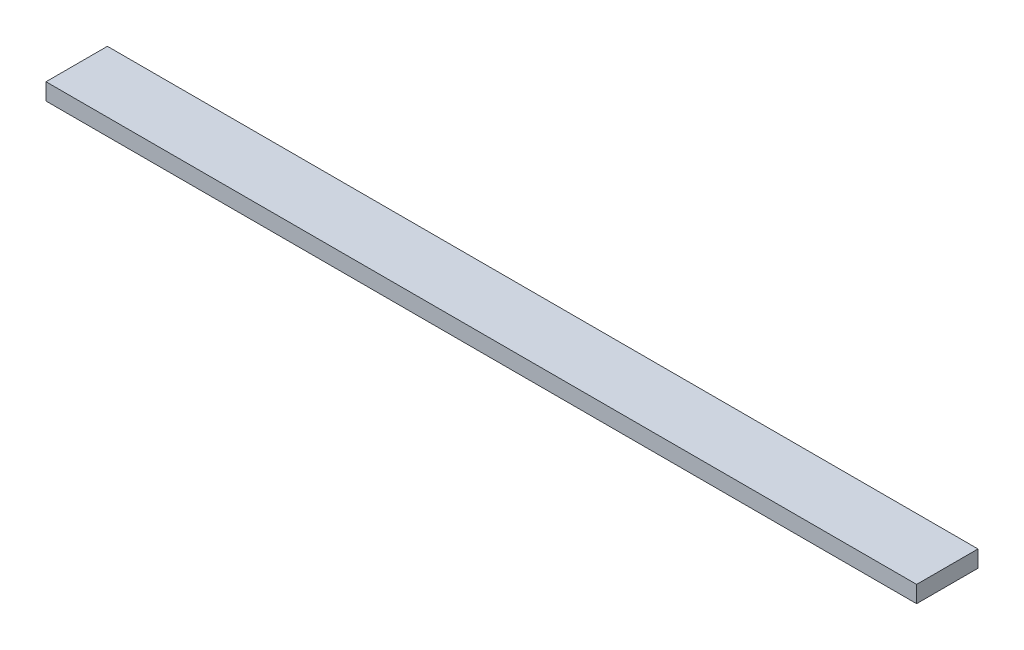
ISO-10303-21;
HEADER;
FILE_DESCRIPTION(('STEP AP214'),'2;1');
FILE_NAME('part.step','',(''),(''),'','','');
FILE_SCHEMA(('AUTOMOTIVE_DESIGN { 1 0 10303 214 1 1 1 1 }'));
ENDSEC;
DATA;
#1=APPLICATION_CONTEXT('core data for automotive mechanical design processes');
#2=APPLICATION_PROTOCOL_DEFINITION('international standard','automotive_design',2000,#1);
#3=PRODUCT_CONTEXT('',#1,'mechanical');
#4=PRODUCT('Part','Part','',(#3));
#5=PRODUCT_RELATED_PRODUCT_CATEGORY('part','',(#4));
#6=PRODUCT_DEFINITION_FORMATION('','',#4);
#7=PRODUCT_DEFINITION_CONTEXT('part definition',#1,'design');
#8=PRODUCT_DEFINITION('design','',#6,#7);
#9=PRODUCT_DEFINITION_SHAPE('','',#8);
#10=(LENGTH_UNIT() NAMED_UNIT(*) SI_UNIT(.MILLI.,.METRE.));
#11=(NAMED_UNIT(*) PLANE_ANGLE_UNIT() SI_UNIT($,.RADIAN.));
#12=(NAMED_UNIT(*) SI_UNIT($,.STERADIAN.) SOLID_ANGLE_UNIT());
#13=UNCERTAINTY_MEASURE_WITH_UNIT(LENGTH_MEASURE(1.E-05),#10,'distance_accuracy_value','');
#14=(GEOMETRIC_REPRESENTATION_CONTEXT(3) GLOBAL_UNCERTAINTY_ASSIGNED_CONTEXT((#13)) GLOBAL_UNIT_ASSIGNED_CONTEXT((#10,
#11,#12)) REPRESENTATION_CONTEXT('',''));
#15=CARTESIAN_POINT('',(0.,0.,0.));
#16=DIRECTION('',(0.,0.,1.));
#17=DIRECTION('',(1.,0.,0.));
#18=AXIS2_PLACEMENT_3D('',#15,#16,#17);
#19=CARTESIAN_POINT('',(0.,19.05,0.));
#20=DIRECTION('',(1.,0.,0.));
#21=DIRECTION('',(0.,0.,-1.));
#22=AXIS2_PLACEMENT_3D('',#19,#20,#21);
#23=PLANE('',#22);
#24=DIRECTION('',(0.,0.,1.));
#25=VECTOR('',#24,1.);
#26=CARTESIAN_POINT('',(0.,0.,0.));
#27=LINE('',#26,#25);
#28=CARTESIAN_POINT('',(0.,0.,-69.85));
#29=VERTEX_POINT('',#28);
#30=CARTESIAN_POINT('',(0.,0.,0.));
#31=VERTEX_POINT('',#30);
#32=EDGE_CURVE('E102',#29,#31,#27,.T.);
#33=ORIENTED_EDGE('',*,*,#32,.T.);
#34=DIRECTION('',(0.,-1.,0.));
#35=VECTOR('',#34,1.);
#36=CARTESIAN_POINT('',(0.,19.05,0.));
#37=LINE('',#36,#35);
#38=CARTESIAN_POINT('',(0.,19.05,0.));
#39=VERTEX_POINT('',#38);
#40=EDGE_CURVE('E11',#39,#31,#37,.T.);
#41=ORIENTED_EDGE('',*,*,#40,.F.);
#42=DIRECTION('',(0.,0.,1.));
#43=VECTOR('',#42,1.);
#44=CARTESIAN_POINT('',(0.,19.05,0.));
#45=LINE('',#44,#43);
#46=CARTESIAN_POINT('',(0.,19.05,-69.85));
#47=VERTEX_POINT('',#46);
#48=EDGE_CURVE('E90',#47,#39,#45,.T.);
#49=ORIENTED_EDGE('',*,*,#48,.F.);
#50=DIRECTION('',(0.,-1.,0.));
#51=VECTOR('',#50,1.);
#52=CARTESIAN_POINT('',(0.,19.05,-69.85));
#53=LINE('',#52,#51);
#54=EDGE_CURVE('E98',#47,#29,#53,.T.);
#55=ORIENTED_EDGE('',*,*,#54,.T.);
#56=EDGE_LOOP('',(#33,#41,#49,#55));
#57=FACE_BOUND('',#56,.T.);
#58=ADVANCED_FACE('F39',(#57),#23,.F.);
#59=CARTESIAN_POINT('',(0.,19.05,0.));
#60=DIRECTION('',(0.,0.,-1.));
#61=DIRECTION('',(-1.,0.,0.));
#62=AXIS2_PLACEMENT_3D('',#59,#60,#61);
#63=PLANE('',#62);
#64=DIRECTION('',(1.,0.,0.));
#65=VECTOR('',#64,1.);
#66=CARTESIAN_POINT('',(0.,0.,0.));
#67=LINE('',#66,#65);
#68=CARTESIAN_POINT('',(990.6,0.,0.));
#69=VERTEX_POINT('',#68);
#70=EDGE_CURVE('E94',#31,#69,#67,.T.);
#71=ORIENTED_EDGE('',*,*,#70,.T.);
#72=DIRECTION('',(0.,-1.,0.));
#73=VECTOR('',#72,1.);
#74=CARTESIAN_POINT('',(990.6,19.05,0.));
#75=LINE('',#74,#73);
#76=CARTESIAN_POINT('',(990.6,19.05,0.));
#77=VERTEX_POINT('',#76);
#78=EDGE_CURVE('E47',#77,#69,#75,.T.);
#79=ORIENTED_EDGE('',*,*,#78,.F.);
#80=DIRECTION('',(1.,0.,0.));
#81=VECTOR('',#80,1.);
#82=CARTESIAN_POINT('',(0.,19.05,0.));
#83=LINE('',#82,#81);
#84=EDGE_CURVE('E85',#39,#77,#83,.T.);
#85=ORIENTED_EDGE('',*,*,#84,.F.);
#86=ORIENTED_EDGE('',*,*,#40,.T.);
#87=EDGE_LOOP('',(#71,#79,#85,#86));
#88=FACE_BOUND('',#87,.T.);
#89=ADVANCED_FACE('F93',(#88),#63,.F.);
#90=CARTESIAN_POINT('',(990.6,19.05,0.));
#91=DIRECTION('',(-1.,0.,0.));
#92=DIRECTION('',(0.,0.,1.));
#93=AXIS2_PLACEMENT_3D('',#90,#91,#92);
#94=PLANE('',#93);
#95=DIRECTION('',(0.,0.,-1.));
#96=VECTOR('',#95,1.);
#97=CARTESIAN_POINT('',(990.6,0.,0.));
#98=LINE('',#97,#96);
#99=CARTESIAN_POINT('',(990.6,0.,-69.85));
#100=VERTEX_POINT('',#99);
#101=EDGE_CURVE('E72',#69,#100,#98,.T.);
#102=ORIENTED_EDGE('',*,*,#101,.T.);
#103=DIRECTION('',(0.,-1.,0.));
#104=VECTOR('',#103,1.);
#105=CARTESIAN_POINT('',(990.6,19.05,-69.85));
#106=LINE('',#105,#104);
#107=CARTESIAN_POINT('',(990.6,19.05,-69.85));
#108=VERTEX_POINT('',#107);
#109=EDGE_CURVE('E95',#108,#100,#106,.T.);
#110=ORIENTED_EDGE('',*,*,#109,.F.);
#111=DIRECTION('',(0.,0.,-1.));
#112=VECTOR('',#111,1.);
#113=CARTESIAN_POINT('',(990.6,19.05,0.));
#114=LINE('',#113,#112);
#115=EDGE_CURVE('E88',#77,#108,#114,.T.);
#116=ORIENTED_EDGE('',*,*,#115,.F.);
#117=ORIENTED_EDGE('',*,*,#78,.T.);
#118=EDGE_LOOP('',(#102,#110,#116,#117));
#119=FACE_BOUND('',#118,.T.);
#120=ADVANCED_FACE('F96',(#119),#94,.F.);
#121=CARTESIAN_POINT('',(0.,19.05,-69.85));
#122=DIRECTION('',(0.,0.,1.));
#123=DIRECTION('',(1.,0.,0.));
#124=AXIS2_PLACEMENT_3D('',#121,#122,#123);
#125=PLANE('',#124);
#126=DIRECTION('',(-1.,0.,0.));
#127=VECTOR('',#126,1.);
#128=CARTESIAN_POINT('',(0.,0.,-69.85));
#129=LINE('',#128,#127);
#130=EDGE_CURVE('E78',#100,#29,#129,.T.);
#131=ORIENTED_EDGE('',*,*,#130,.T.);
#132=ORIENTED_EDGE('',*,*,#54,.F.);
#133=DIRECTION('',(-1.,0.,0.));
#134=VECTOR('',#133,1.);
#135=CARTESIAN_POINT('',(0.,19.05,-69.85));
#136=LINE('',#135,#134);
#137=EDGE_CURVE('E55',#108,#47,#136,.T.);
#138=ORIENTED_EDGE('',*,*,#137,.F.);
#139=ORIENTED_EDGE('',*,*,#109,.T.);
#140=EDGE_LOOP('',(#131,#132,#138,#139));
#141=FACE_BOUND('',#140,.T.);
#142=ADVANCED_FACE('F109',(#141),#125,.F.);
#143=CARTESIAN_POINT('',(0.,19.05,0.));
#144=DIRECTION('',(0.,-1.,0.));
#145=DIRECTION('',(0.,0.,-1.));
#146=AXIS2_PLACEMENT_3D('',#143,#144,#145);
#147=PLANE('',#146);
#148=ORIENTED_EDGE('',*,*,#48,.T.);
#149=ORIENTED_EDGE('',*,*,#84,.T.);
#150=ORIENTED_EDGE('',*,*,#115,.T.);
#151=ORIENTED_EDGE('',*,*,#137,.T.);
#152=EDGE_LOOP('',(#148,#149,#150,#151));
#153=FACE_BOUND('',#152,.T.);
#154=ADVANCED_FACE('F86',(#153),#147,.F.);
#155=CARTESIAN_POINT('',(0.,0.,0.));
#156=DIRECTION('',(0.,-1.,0.));
#157=DIRECTION('',(0.,0.,-1.));
#158=AXIS2_PLACEMENT_3D('',#155,#156,#157);
#159=PLANE('',#158);
#160=ORIENTED_EDGE('',*,*,#32,.F.);
#161=ORIENTED_EDGE('',*,*,#130,.F.);
#162=ORIENTED_EDGE('',*,*,#101,.F.);
#163=ORIENTED_EDGE('',*,*,#70,.F.);
#164=EDGE_LOOP('',(#160,#161,#162,#163));
#165=FACE_BOUND('',#164,.T.);
#166=ADVANCED_FACE('F112',(#165),#159,.T.);
#167=CLOSED_SHELL('',(#58,#89,#120,#142,#154,#166));
#168=MANIFOLD_SOLID_BREP('B2',#167);
#169=ADVANCED_BREP_SHAPE_REPRESENTATION('',(#18,#168),#14);
#170=SHAPE_DEFINITION_REPRESENTATION(#9,#169);
ENDSEC;
END-ISO-10303-21;
